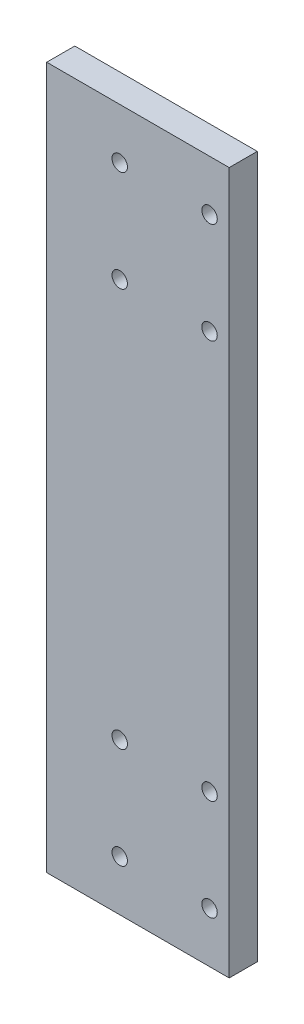
ISO-10303-21;
HEADER;
FILE_DESCRIPTION(('STEP AP214'),'2;1');
FILE_NAME('part.step','',(''),(''),'','','');
FILE_SCHEMA(('AUTOMOTIVE_DESIGN { 1 0 10303 214 1 1 1 1 }'));
ENDSEC;
DATA;
#1=APPLICATION_CONTEXT('core data for automotive mechanical design processes');
#2=APPLICATION_PROTOCOL_DEFINITION('international standard','automotive_design',2000,#1);
#3=PRODUCT_CONTEXT('',#1,'mechanical');
#4=PRODUCT('Part','Part','',(#3));
#5=PRODUCT_RELATED_PRODUCT_CATEGORY('part','',(#4));
#6=PRODUCT_DEFINITION_FORMATION('','',#4);
#7=PRODUCT_DEFINITION_CONTEXT('part definition',#1,'design');
#8=PRODUCT_DEFINITION('design','',#6,#7);
#9=PRODUCT_DEFINITION_SHAPE('','',#8);
#10=(LENGTH_UNIT() NAMED_UNIT(*) SI_UNIT(.MILLI.,.METRE.));
#11=(NAMED_UNIT(*) PLANE_ANGLE_UNIT() SI_UNIT($,.RADIAN.));
#12=(NAMED_UNIT(*) SI_UNIT($,.STERADIAN.) SOLID_ANGLE_UNIT());
#13=UNCERTAINTY_MEASURE_WITH_UNIT(LENGTH_MEASURE(1.E-05),#10,'distance_accuracy_value','');
#14=(GEOMETRIC_REPRESENTATION_CONTEXT(3) GLOBAL_UNCERTAINTY_ASSIGNED_CONTEXT((#13)) GLOBAL_UNIT_ASSIGNED_CONTEXT((#10,
#11,#12)) REPRESENTATION_CONTEXT('',''));
#15=CARTESIAN_POINT('',(0.,0.,0.));
#16=DIRECTION('',(0.,0.,1.));
#17=DIRECTION('',(1.,0.,0.));
#18=AXIS2_PLACEMENT_3D('',#15,#16,#17);
#19=CARTESIAN_POINT('',(32.5,125.,10.));
#20=DIRECTION('',(-1.,0.,0.));
#21=DIRECTION('',(0.,-1.,0.));
#22=AXIS2_PLACEMENT_3D('',#19,#20,#21);
#23=PLANE('',#22);
#24=DIRECTION('',(0.,1.,0.));
#25=VECTOR('',#24,1.);
#26=CARTESIAN_POINT('',(32.5,125.,0.));
#27=LINE('',#26,#25);
#28=CARTESIAN_POINT('',(32.5,-125.,0.));
#29=VERTEX_POINT('',#28);
#30=CARTESIAN_POINT('',(32.5,125.,0.));
#31=VERTEX_POINT('',#30);
#32=EDGE_CURVE('E252',#29,#31,#27,.T.);
#33=ORIENTED_EDGE('',*,*,#32,.T.);
#34=DIRECTION('',(0.,0.,-1.));
#35=VECTOR('',#34,1.);
#36=CARTESIAN_POINT('',(32.5,125.,10.));
#37=LINE('',#36,#35);
#38=CARTESIAN_POINT('',(32.5,125.,10.));
#39=VERTEX_POINT('',#38);
#40=EDGE_CURVE('E11',#39,#31,#37,.T.);
#41=ORIENTED_EDGE('',*,*,#40,.F.);
#42=DIRECTION('',(0.,1.,0.));
#43=VECTOR('',#42,1.);
#44=CARTESIAN_POINT('',(32.5,125.,10.));
#45=LINE('',#44,#43);
#46=CARTESIAN_POINT('',(32.5,-125.,10.));
#47=VERTEX_POINT('',#46);
#48=EDGE_CURVE('E245',#47,#39,#45,.T.);
#49=ORIENTED_EDGE('',*,*,#48,.F.);
#50=DIRECTION('',(0.,0.,-1.));
#51=VECTOR('',#50,1.);
#52=CARTESIAN_POINT('',(32.5,-125.,10.));
#53=LINE('',#52,#51);
#54=EDGE_CURVE('E251',#47,#29,#53,.T.);
#55=ORIENTED_EDGE('',*,*,#54,.T.);
#56=EDGE_LOOP('',(#33,#41,#49,#55));
#57=FACE_BOUND('',#56,.T.);
#58=ADVANCED_FACE('F44',(#57),#23,.F.);
#59=CARTESIAN_POINT('',(-32.5,125.,10.));
#60=DIRECTION('',(0.,-1.,0.));
#61=DIRECTION('',(0.,0.,-1.));
#62=AXIS2_PLACEMENT_3D('',#59,#60,#61);
#63=PLANE('',#62);
#64=DIRECTION('',(-1.,0.,0.));
#65=VECTOR('',#64,1.);
#66=CARTESIAN_POINT('',(-32.5,125.,0.));
#67=LINE('',#66,#65);
#68=CARTESIAN_POINT('',(-32.5,125.,0.));
#69=VERTEX_POINT('',#68);
#70=EDGE_CURVE('E255',#31,#69,#67,.T.);
#71=ORIENTED_EDGE('',*,*,#70,.T.);
#72=DIRECTION('',(0.,0.,-1.));
#73=VECTOR('',#72,1.);
#74=CARTESIAN_POINT('',(-32.5,125.,10.));
#75=LINE('',#74,#73);
#76=CARTESIAN_POINT('',(-32.5,125.,10.));
#77=VERTEX_POINT('',#76);
#78=EDGE_CURVE('E53',#77,#69,#75,.T.);
#79=ORIENTED_EDGE('',*,*,#78,.F.);
#80=DIRECTION('',(-1.,0.,0.));
#81=VECTOR('',#80,1.);
#82=CARTESIAN_POINT('',(-32.5,125.,10.));
#83=LINE('',#82,#81);
#84=EDGE_CURVE('E93',#39,#77,#83,.T.);
#85=ORIENTED_EDGE('',*,*,#84,.F.);
#86=ORIENTED_EDGE('',*,*,#40,.T.);
#87=EDGE_LOOP('',(#71,#79,#85,#86));
#88=FACE_BOUND('',#87,.T.);
#89=ADVANCED_FACE('F302',(#88),#63,.F.);
#90=CARTESIAN_POINT('',(-32.5,125.,10.));
#91=DIRECTION('',(1.,0.,0.));
#92=DIRECTION('',(0.,1.,0.));
#93=AXIS2_PLACEMENT_3D('',#90,#91,#92);
#94=PLANE('',#93);
#95=CARTESIAN_POINT('',(-32.5,-70.,5.));
#96=DIRECTION('',(-1.,0.,0.));
#97=DIRECTION('',(0.,0.,1.));
#98=AXIS2_PLACEMENT_3D('',#95,#96,#97);
#99=CIRCLE('',#98,2.5);
#100=CARTESIAN_POINT('',(-32.5,-70.,7.5));
#101=VERTEX_POINT('',#100);
#102=EDGE_CURVE('E126',#101,#101,#99,.T.);
#103=ORIENTED_EDGE('',*,*,#102,.F.);
#104=EDGE_LOOP('',(#103));
#105=FACE_BOUND('',#104,.T.);
#106=CARTESIAN_POINT('',(-32.5,-35.,5.));
#107=DIRECTION('',(-1.,0.,0.));
#108=DIRECTION('',(0.,0.,1.));
#109=AXIS2_PLACEMENT_3D('',#106,#107,#108);
#110=CIRCLE('',#109,2.5);
#111=CARTESIAN_POINT('',(-32.5,-35.,7.5));
#112=VERTEX_POINT('',#111);
#113=EDGE_CURVE('E125',#112,#112,#110,.T.);
#114=ORIENTED_EDGE('',*,*,#113,.F.);
#115=EDGE_LOOP('',(#114));
#116=FACE_BOUND('',#115,.T.);
#117=CARTESIAN_POINT('',(-32.5,0.,5.));
#118=DIRECTION('',(-1.,0.,0.));
#119=DIRECTION('',(0.,0.,1.));
#120=AXIS2_PLACEMENT_3D('',#117,#118,#119);
#121=CIRCLE('',#120,2.5);
#122=CARTESIAN_POINT('',(-32.5,0.,7.5));
#123=VERTEX_POINT('',#122);
#124=EDGE_CURVE('E136',#123,#123,#121,.T.);
#125=ORIENTED_EDGE('',*,*,#124,.F.);
#126=EDGE_LOOP('',(#125));
#127=FACE_BOUND('',#126,.T.);
#128=CARTESIAN_POINT('',(-32.5,35.,5.));
#129=DIRECTION('',(-1.,0.,0.));
#130=DIRECTION('',(0.,0.,1.));
#131=AXIS2_PLACEMENT_3D('',#128,#129,#130);
#132=CIRCLE('',#131,2.5);
#133=CARTESIAN_POINT('',(-32.5,35.,7.5));
#134=VERTEX_POINT('',#133);
#135=EDGE_CURVE('E142',#134,#134,#132,.T.);
#136=ORIENTED_EDGE('',*,*,#135,.F.);
#137=EDGE_LOOP('',(#136));
#138=FACE_BOUND('',#137,.T.);
#139=CARTESIAN_POINT('',(-32.5,70.,5.));
#140=DIRECTION('',(-1.,0.,0.));
#141=DIRECTION('',(0.,0.,1.));
#142=AXIS2_PLACEMENT_3D('',#139,#140,#141);
#143=CIRCLE('',#142,2.5);
#144=CARTESIAN_POINT('',(-32.5,70.,7.5));
#145=VERTEX_POINT('',#144);
#146=EDGE_CURVE('E148',#145,#145,#143,.T.);
#147=ORIENTED_EDGE('',*,*,#146,.F.);
#148=EDGE_LOOP('',(#147));
#149=FACE_BOUND('',#148,.T.);
#150=CARTESIAN_POINT('',(-32.5,-105.,5.));
#151=DIRECTION('',(-1.,0.,0.));
#152=DIRECTION('',(0.,0.,1.));
#153=AXIS2_PLACEMENT_3D('',#150,#151,#152);
#154=CIRCLE('',#153,2.5);
#155=CARTESIAN_POINT('',(-32.5,-105.,7.5));
#156=VERTEX_POINT('',#155);
#157=EDGE_CURVE('E154',#156,#156,#154,.T.);
#158=ORIENTED_EDGE('',*,*,#157,.F.);
#159=EDGE_LOOP('',(#158));
#160=FACE_BOUND('',#159,.T.);
#161=CARTESIAN_POINT('',(-32.5,105.,5.));
#162=DIRECTION('',(-1.,0.,0.));
#163=DIRECTION('',(0.,0.,1.));
#164=AXIS2_PLACEMENT_3D('',#161,#162,#163);
#165=CIRCLE('',#164,2.5);
#166=CARTESIAN_POINT('',(-32.5,105.,7.5));
#167=VERTEX_POINT('',#166);
#168=EDGE_CURVE('E160',#167,#167,#165,.T.);
#169=ORIENTED_EDGE('',*,*,#168,.F.);
#170=EDGE_LOOP('',(#169));
#171=FACE_BOUND('',#170,.T.);
#172=DIRECTION('',(0.,-1.,0.));
#173=VECTOR('',#172,1.);
#174=CARTESIAN_POINT('',(-32.5,125.,0.));
#175=LINE('',#174,#173);
#176=CARTESIAN_POINT('',(-32.5,-125.,0.));
#177=VERTEX_POINT('',#176);
#178=EDGE_CURVE('E80',#69,#177,#175,.T.);
#179=ORIENTED_EDGE('',*,*,#178,.T.);
#180=DIRECTION('',(0.,0.,-1.));
#181=VECTOR('',#180,1.);
#182=CARTESIAN_POINT('',(-32.5,-125.,10.));
#183=LINE('',#182,#181);
#184=CARTESIAN_POINT('',(-32.5,-125.,10.));
#185=VERTEX_POINT('',#184);
#186=EDGE_CURVE('E260',#185,#177,#183,.T.);
#187=ORIENTED_EDGE('',*,*,#186,.F.);
#188=DIRECTION('',(0.,-1.,0.));
#189=VECTOR('',#188,1.);
#190=CARTESIAN_POINT('',(-32.5,125.,10.));
#191=LINE('',#190,#189);
#192=EDGE_CURVE('E248',#77,#185,#191,.T.);
#193=ORIENTED_EDGE('',*,*,#192,.F.);
#194=ORIENTED_EDGE('',*,*,#78,.T.);
#195=EDGE_LOOP('',(#179,#187,#193,#194));
#196=FACE_BOUND('',#195,.T.);
#197=ADVANCED_FACE('F305',(#105,#116,#127,#138,#149,#160,#171,#196),#94,.F.);
#198=CARTESIAN_POINT('',(-32.5,-125.,10.));
#199=DIRECTION('',(0.,1.,0.));
#200=DIRECTION('',(0.,0.,1.));
#201=AXIS2_PLACEMENT_3D('',#198,#199,#200);
#202=PLANE('',#201);
#203=DIRECTION('',(1.,0.,0.));
#204=VECTOR('',#203,1.);
#205=CARTESIAN_POINT('',(-32.5,-125.,0.));
#206=LINE('',#205,#204);
#207=EDGE_CURVE('E86',#177,#29,#206,.T.);
#208=ORIENTED_EDGE('',*,*,#207,.T.);
#209=ORIENTED_EDGE('',*,*,#54,.F.);
#210=DIRECTION('',(1.,0.,0.));
#211=VECTOR('',#210,1.);
#212=CARTESIAN_POINT('',(-32.5,-125.,10.));
#213=LINE('',#212,#211);
#214=EDGE_CURVE('E62',#185,#47,#213,.T.);
#215=ORIENTED_EDGE('',*,*,#214,.F.);
#216=ORIENTED_EDGE('',*,*,#186,.T.);
#217=EDGE_LOOP('',(#208,#209,#215,#216));
#218=FACE_BOUND('',#217,.T.);
#219=ADVANCED_FACE('F284',(#218),#202,.F.);
#220=CARTESIAN_POINT('',(0.,0.,10.));
#221=DIRECTION('',(0.,0.,1.));
#222=DIRECTION('',(1.,0.,0.));
#223=AXIS2_PLACEMENT_3D('',#220,#221,#222);
#224=PLANE('',#223);
#225=CARTESIAN_POINT('',(-6.49999999999999,107.,10.));
#226=DIRECTION('',(0.,0.,1.));
#227=DIRECTION('',(1.,0.,0.));
#228=AXIS2_PLACEMENT_3D('',#225,#226,#227);
#229=CIRCLE('',#228,2.75);
#230=CARTESIAN_POINT('',(-3.75,107.,10.));
#231=VERTEX_POINT('',#230);
#232=EDGE_CURVE('E47',#231,#231,#229,.T.);
#233=ORIENTED_EDGE('',*,*,#232,.F.);
#234=EDGE_LOOP('',(#233));
#235=FACE_BOUND('',#234,.T.);
#236=CARTESIAN_POINT('',(25.5,107.,10.));
#237=DIRECTION('',(0.,0.,1.));
#238=DIRECTION('',(1.,0.,0.));
#239=AXIS2_PLACEMENT_3D('',#236,#237,#238);
#240=CIRCLE('',#239,2.75);
#241=CARTESIAN_POINT('',(28.25,107.,10.));
#242=VERTEX_POINT('',#241);
#243=EDGE_CURVE('E184',#242,#242,#240,.T.);
#244=ORIENTED_EDGE('',*,*,#243,.F.);
#245=EDGE_LOOP('',(#244));
#246=FACE_BOUND('',#245,.T.);
#247=CARTESIAN_POINT('',(-6.5,71.,10.));
#248=DIRECTION('',(0.,0.,1.));
#249=DIRECTION('',(1.,0.,0.));
#250=AXIS2_PLACEMENT_3D('',#247,#248,#249);
#251=CIRCLE('',#250,2.75);
#252=CARTESIAN_POINT('',(-3.75000000000001,71.,10.));
#253=VERTEX_POINT('',#252);
#254=EDGE_CURVE('E194',#253,#253,#251,.T.);
#255=ORIENTED_EDGE('',*,*,#254,.F.);
#256=EDGE_LOOP('',(#255));
#257=FACE_BOUND('',#256,.T.);
#258=CARTESIAN_POINT('',(25.5,71.,10.));
#259=DIRECTION('',(0.,0.,1.));
#260=DIRECTION('',(1.,0.,0.));
#261=AXIS2_PLACEMENT_3D('',#258,#259,#260);
#262=CIRCLE('',#261,2.75);
#263=CARTESIAN_POINT('',(28.25,71.,10.));
#264=VERTEX_POINT('',#263);
#265=EDGE_CURVE('E204',#264,#264,#262,.T.);
#266=ORIENTED_EDGE('',*,*,#265,.F.);
#267=EDGE_LOOP('',(#266));
#268=FACE_BOUND('',#267,.T.);
#269=CARTESIAN_POINT('',(25.5,-71.,10.));
#270=DIRECTION('',(0.,0.,1.));
#271=DIRECTION('',(1.,0.,0.));
#272=AXIS2_PLACEMENT_3D('',#269,#270,#271);
#273=CIRCLE('',#272,2.75);
#274=CARTESIAN_POINT('',(28.25,-71.,10.));
#275=VERTEX_POINT('',#274);
#276=EDGE_CURVE('E214',#275,#275,#273,.T.);
#277=ORIENTED_EDGE('',*,*,#276,.F.);
#278=EDGE_LOOP('',(#277));
#279=FACE_BOUND('',#278,.T.);
#280=CARTESIAN_POINT('',(-6.5,-71.,10.));
#281=DIRECTION('',(0.,0.,1.));
#282=DIRECTION('',(1.,0.,0.));
#283=AXIS2_PLACEMENT_3D('',#280,#281,#282);
#284=CIRCLE('',#283,2.75);
#285=CARTESIAN_POINT('',(-3.75000000000001,-71.,10.));
#286=VERTEX_POINT('',#285);
#287=EDGE_CURVE('E224',#286,#286,#284,.T.);
#288=ORIENTED_EDGE('',*,*,#287,.F.);
#289=EDGE_LOOP('',(#288));
#290=FACE_BOUND('',#289,.T.);
#291=CARTESIAN_POINT('',(-6.49999999999999,-107.,10.));
#292=DIRECTION('',(0.,0.,1.));
#293=DIRECTION('',(1.,0.,0.));
#294=AXIS2_PLACEMENT_3D('',#291,#292,#293);
#295=CIRCLE('',#294,2.75);
#296=CARTESIAN_POINT('',(-3.75,-107.,10.));
#297=VERTEX_POINT('',#296);
#298=EDGE_CURVE('E234',#297,#297,#295,.T.);
#299=ORIENTED_EDGE('',*,*,#298,.F.);
#300=EDGE_LOOP('',(#299));
#301=FACE_BOUND('',#300,.T.);
#302=CARTESIAN_POINT('',(25.5,-107.,10.));
#303=DIRECTION('',(0.,0.,1.));
#304=DIRECTION('',(1.,0.,0.));
#305=AXIS2_PLACEMENT_3D('',#302,#303,#304);
#306=CIRCLE('',#305,2.75);
#307=CARTESIAN_POINT('',(28.25,-107.,10.));
#308=VERTEX_POINT('',#307);
#309=EDGE_CURVE('E244',#308,#308,#306,.T.);
#310=ORIENTED_EDGE('',*,*,#309,.F.);
#311=EDGE_LOOP('',(#310));
#312=FACE_BOUND('',#311,.T.);
#313=ORIENTED_EDGE('',*,*,#48,.T.);
#314=ORIENTED_EDGE('',*,*,#84,.T.);
#315=ORIENTED_EDGE('',*,*,#192,.T.);
#316=ORIENTED_EDGE('',*,*,#214,.T.);
#317=EDGE_LOOP('',(#313,#314,#315,#316));
#318=FACE_BOUND('',#317,.T.);
#319=ADVANCED_FACE('F280',(#235,#246,#257,#268,#279,#290,#301,#312,#318),#224,.T.);
#320=CARTESIAN_POINT('',(0.,0.,0.));
#321=DIRECTION('',(0.,0.,1.));
#322=DIRECTION('',(1.,0.,0.));
#323=AXIS2_PLACEMENT_3D('',#320,#321,#322);
#324=PLANE('',#323);
#325=CARTESIAN_POINT('',(-6.49999999999999,107.,0.));
#326=DIRECTION('',(0.,0.,-1.));
#327=DIRECTION('',(-1.,0.,0.));
#328=AXIS2_PLACEMENT_3D('',#325,#326,#327);
#329=CIRCLE('',#328,5.);
#330=CARTESIAN_POINT('',(-11.5,107.,0.));
#331=VERTEX_POINT('',#330);
#332=EDGE_CURVE('E166',#331,#331,#329,.T.);
#333=ORIENTED_EDGE('',*,*,#332,.F.);
#334=EDGE_LOOP('',(#333));
#335=FACE_BOUND('',#334,.T.);
#336=CARTESIAN_POINT('',(25.5,107.,0.));
#337=DIRECTION('',(0.,0.,-1.));
#338=DIRECTION('',(-1.,0.,0.));
#339=AXIS2_PLACEMENT_3D('',#336,#337,#338);
#340=CIRCLE('',#339,5.);
#341=CARTESIAN_POINT('',(20.5,107.,0.));
#342=VERTEX_POINT('',#341);
#343=EDGE_CURVE('E175',#342,#342,#340,.T.);
#344=ORIENTED_EDGE('',*,*,#343,.F.);
#345=EDGE_LOOP('',(#344));
#346=FACE_BOUND('',#345,.T.);
#347=CARTESIAN_POINT('',(-6.5,71.,0.));
#348=DIRECTION('',(0.,0.,-1.));
#349=DIRECTION('',(-1.,0.,0.));
#350=AXIS2_PLACEMENT_3D('',#347,#348,#349);
#351=CIRCLE('',#350,5.);
#352=CARTESIAN_POINT('',(-11.5,71.,0.));
#353=VERTEX_POINT('',#352);
#354=EDGE_CURVE('E185',#353,#353,#351,.T.);
#355=ORIENTED_EDGE('',*,*,#354,.F.);
#356=EDGE_LOOP('',(#355));
#357=FACE_BOUND('',#356,.T.);
#358=CARTESIAN_POINT('',(25.5,71.,0.));
#359=DIRECTION('',(0.,0.,-1.));
#360=DIRECTION('',(-1.,0.,0.));
#361=AXIS2_PLACEMENT_3D('',#358,#359,#360);
#362=CIRCLE('',#361,5.);
#363=CARTESIAN_POINT('',(20.5,71.,0.));
#364=VERTEX_POINT('',#363);
#365=EDGE_CURVE('E195',#364,#364,#362,.T.);
#366=ORIENTED_EDGE('',*,*,#365,.F.);
#367=EDGE_LOOP('',(#366));
#368=FACE_BOUND('',#367,.T.);
#369=CARTESIAN_POINT('',(25.5,-71.,0.));
#370=DIRECTION('',(0.,0.,-1.));
#371=DIRECTION('',(-1.,0.,0.));
#372=AXIS2_PLACEMENT_3D('',#369,#370,#371);
#373=CIRCLE('',#372,5.);
#374=CARTESIAN_POINT('',(20.5,-71.,0.));
#375=VERTEX_POINT('',#374);
#376=EDGE_CURVE('E205',#375,#375,#373,.T.);
#377=ORIENTED_EDGE('',*,*,#376,.F.);
#378=EDGE_LOOP('',(#377));
#379=FACE_BOUND('',#378,.T.);
#380=CARTESIAN_POINT('',(-6.5,-71.,0.));
#381=DIRECTION('',(0.,0.,-1.));
#382=DIRECTION('',(-1.,0.,0.));
#383=AXIS2_PLACEMENT_3D('',#380,#381,#382);
#384=CIRCLE('',#383,5.);
#385=CARTESIAN_POINT('',(-11.5,-71.,0.));
#386=VERTEX_POINT('',#385);
#387=EDGE_CURVE('E215',#386,#386,#384,.T.);
#388=ORIENTED_EDGE('',*,*,#387,.F.);
#389=EDGE_LOOP('',(#388));
#390=FACE_BOUND('',#389,.T.);
#391=CARTESIAN_POINT('',(-6.49999999999999,-107.,0.));
#392=DIRECTION('',(0.,0.,-1.));
#393=DIRECTION('',(-1.,0.,0.));
#394=AXIS2_PLACEMENT_3D('',#391,#392,#393);
#395=CIRCLE('',#394,5.);
#396=CARTESIAN_POINT('',(-11.5,-107.,0.));
#397=VERTEX_POINT('',#396);
#398=EDGE_CURVE('E225',#397,#397,#395,.T.);
#399=ORIENTED_EDGE('',*,*,#398,.F.);
#400=EDGE_LOOP('',(#399));
#401=FACE_BOUND('',#400,.T.);
#402=CARTESIAN_POINT('',(25.5,-107.,0.));
#403=DIRECTION('',(0.,0.,-1.));
#404=DIRECTION('',(-1.,0.,0.));
#405=AXIS2_PLACEMENT_3D('',#402,#403,#404);
#406=CIRCLE('',#405,5.);
#407=CARTESIAN_POINT('',(20.5,-107.,0.));
#408=VERTEX_POINT('',#407);
#409=EDGE_CURVE('E235',#408,#408,#406,.T.);
#410=ORIENTED_EDGE('',*,*,#409,.F.);
#411=EDGE_LOOP('',(#410));
#412=FACE_BOUND('',#411,.T.);
#413=ORIENTED_EDGE('',*,*,#32,.F.);
#414=ORIENTED_EDGE('',*,*,#207,.F.);
#415=ORIENTED_EDGE('',*,*,#178,.F.);
#416=ORIENTED_EDGE('',*,*,#70,.F.);
#417=EDGE_LOOP('',(#413,#414,#415,#416));
#418=FACE_BOUND('',#417,.T.);
#419=ADVANCED_FACE('F283',(#335,#346,#357,#368,#379,#390,#401,#412,#418),#324,.F.);
#420=CARTESIAN_POINT('',(25.5,-107.,0.));
#421=DIRECTION('',(0.,0.,-1.));
#422=DIRECTION('',(-1.,0.,0.));
#423=AXIS2_PLACEMENT_3D('',#420,#421,#422);
#424=CYLINDRICAL_SURFACE('',#423,2.75);
#425=ORIENTED_EDGE('',*,*,#309,.T.);
#426=EDGE_LOOP('',(#425));
#427=FACE_BOUND('',#426,.T.);
#428=CARTESIAN_POINT('',(25.5,-107.,5.7));
#429=DIRECTION('',(0.,0.,-1.));
#430=DIRECTION('',(-1.,0.,0.));
#431=AXIS2_PLACEMENT_3D('',#428,#429,#430);
#432=CIRCLE('',#431,2.75);
#433=CARTESIAN_POINT('',(22.75,-107.,5.7));
#434=VERTEX_POINT('',#433);
#435=EDGE_CURVE('E241',#434,#434,#432,.T.);
#436=ORIENTED_EDGE('',*,*,#435,.T.);
#437=EDGE_LOOP('',(#436));
#438=FACE_BOUND('',#437,.T.);
#439=ADVANCED_FACE('F307',(#427,#438),#424,.F.);
#440=CARTESIAN_POINT('',(28.25,-107.,5.7));
#441=DIRECTION('',(0.,0.,1.));
#442=DIRECTION('',(1.,0.,0.));
#443=AXIS2_PLACEMENT_3D('',#440,#441,#442);
#444=PLANE('',#443);
#445=ORIENTED_EDGE('',*,*,#435,.F.);
#446=EDGE_LOOP('',(#445));
#447=FACE_BOUND('',#446,.T.);
#448=CARTESIAN_POINT('',(25.5,-107.,5.7));
#449=DIRECTION('',(0.,0.,-1.));
#450=DIRECTION('',(-1.,0.,0.));
#451=AXIS2_PLACEMENT_3D('',#448,#449,#450);
#452=CIRCLE('',#451,5.);
#453=CARTESIAN_POINT('',(20.5,-107.,5.7));
#454=VERTEX_POINT('',#453);
#455=EDGE_CURVE('E238',#454,#454,#452,.T.);
#456=ORIENTED_EDGE('',*,*,#455,.T.);
#457=EDGE_LOOP('',(#456));
#458=FACE_BOUND('',#457,.T.);
#459=ADVANCED_FACE('F314',(#447,#458),#444,.F.);
#460=CARTESIAN_POINT('',(25.5,-107.,0.));
#461=DIRECTION('',(0.,0.,-1.));
#462=DIRECTION('',(-1.,0.,0.));
#463=AXIS2_PLACEMENT_3D('',#460,#461,#462);
#464=CYLINDRICAL_SURFACE('',#463,5.);
#465=ORIENTED_EDGE('',*,*,#455,.F.);
#466=EDGE_LOOP('',(#465));
#467=FACE_BOUND('',#466,.T.);
#468=ORIENTED_EDGE('',*,*,#409,.T.);
#469=EDGE_LOOP('',(#468));
#470=FACE_BOUND('',#469,.T.);
#471=ADVANCED_FACE('F355',(#467,#470),#464,.F.);
#472=CARTESIAN_POINT('',(-6.49999999999999,-107.,0.));
#473=DIRECTION('',(0.,0.,-1.));
#474=DIRECTION('',(-1.,0.,0.));
#475=AXIS2_PLACEMENT_3D('',#472,#473,#474);
#476=CYLINDRICAL_SURFACE('',#475,2.75);
#477=ORIENTED_EDGE('',*,*,#298,.T.);
#478=EDGE_LOOP('',(#477));
#479=FACE_BOUND('',#478,.T.);
#480=CARTESIAN_POINT('',(-6.49999999999999,-107.,5.7));
#481=DIRECTION('',(0.,0.,-1.));
#482=DIRECTION('',(-1.,0.,0.));
#483=AXIS2_PLACEMENT_3D('',#480,#481,#482);
#484=CIRCLE('',#483,2.75);
#485=CARTESIAN_POINT('',(-9.24999999999999,-107.,5.7));
#486=VERTEX_POINT('',#485);
#487=EDGE_CURVE('E231',#486,#486,#484,.T.);
#488=ORIENTED_EDGE('',*,*,#487,.T.);
#489=EDGE_LOOP('',(#488));
#490=FACE_BOUND('',#489,.T.);
#491=ADVANCED_FACE('F363',(#479,#490),#476,.F.);
#492=CARTESIAN_POINT('',(-3.75,-107.,5.7));
#493=DIRECTION('',(0.,0.,1.));
#494=DIRECTION('',(1.,0.,0.));
#495=AXIS2_PLACEMENT_3D('',#492,#493,#494);
#496=PLANE('',#495);
#497=ORIENTED_EDGE('',*,*,#487,.F.);
#498=EDGE_LOOP('',(#497));
#499=FACE_BOUND('',#498,.T.);
#500=CARTESIAN_POINT('',(-6.49999999999999,-107.,5.7));
#501=DIRECTION('',(0.,0.,-1.));
#502=DIRECTION('',(-1.,0.,0.));
#503=AXIS2_PLACEMENT_3D('',#500,#501,#502);
#504=CIRCLE('',#503,5.);
#505=CARTESIAN_POINT('',(-11.5,-107.,5.7));
#506=VERTEX_POINT('',#505);
#507=EDGE_CURVE('E228',#506,#506,#504,.T.);
#508=ORIENTED_EDGE('',*,*,#507,.T.);
#509=EDGE_LOOP('',(#508));
#510=FACE_BOUND('',#509,.T.);
#511=ADVANCED_FACE('F371',(#499,#510),#496,.F.);
#512=CARTESIAN_POINT('',(-6.49999999999999,-107.,0.));
#513=DIRECTION('',(0.,0.,-1.));
#514=DIRECTION('',(-1.,0.,0.));
#515=AXIS2_PLACEMENT_3D('',#512,#513,#514);
#516=CYLINDRICAL_SURFACE('',#515,5.);
#517=ORIENTED_EDGE('',*,*,#507,.F.);
#518=EDGE_LOOP('',(#517));
#519=FACE_BOUND('',#518,.T.);
#520=ORIENTED_EDGE('',*,*,#398,.T.);
#521=EDGE_LOOP('',(#520));
#522=FACE_BOUND('',#521,.T.);
#523=ADVANCED_FACE('F379',(#519,#522),#516,.F.);
#524=CARTESIAN_POINT('',(-6.5,-71.,0.));
#525=DIRECTION('',(0.,0.,-1.));
#526=DIRECTION('',(-1.,0.,0.));
#527=AXIS2_PLACEMENT_3D('',#524,#525,#526);
#528=CYLINDRICAL_SURFACE('',#527,2.75);
#529=ORIENTED_EDGE('',*,*,#287,.T.);
#530=EDGE_LOOP('',(#529));
#531=FACE_BOUND('',#530,.T.);
#532=CARTESIAN_POINT('',(-6.5,-71.,5.7));
#533=DIRECTION('',(0.,0.,-1.));
#534=DIRECTION('',(-1.,0.,0.));
#535=AXIS2_PLACEMENT_3D('',#532,#533,#534);
#536=CIRCLE('',#535,2.75);
#537=CARTESIAN_POINT('',(-9.25,-71.,5.7));
#538=VERTEX_POINT('',#537);
#539=EDGE_CURVE('E221',#538,#538,#536,.T.);
#540=ORIENTED_EDGE('',*,*,#539,.T.);
#541=EDGE_LOOP('',(#540));
#542=FACE_BOUND('',#541,.T.);
#543=ADVANCED_FACE('F387',(#531,#542),#528,.F.);
#544=CARTESIAN_POINT('',(-3.75000000000001,-71.,5.7));
#545=DIRECTION('',(0.,0.,1.));
#546=DIRECTION('',(1.,0.,0.));
#547=AXIS2_PLACEMENT_3D('',#544,#545,#546);
#548=PLANE('',#547);
#549=ORIENTED_EDGE('',*,*,#539,.F.);
#550=EDGE_LOOP('',(#549));
#551=FACE_BOUND('',#550,.T.);
#552=CARTESIAN_POINT('',(-6.5,-71.,5.7));
#553=DIRECTION('',(0.,0.,-1.));
#554=DIRECTION('',(-1.,0.,0.));
#555=AXIS2_PLACEMENT_3D('',#552,#553,#554);
#556=CIRCLE('',#555,5.);
#557=CARTESIAN_POINT('',(-11.5,-71.,5.7));
#558=VERTEX_POINT('',#557);
#559=EDGE_CURVE('E218',#558,#558,#556,.T.);
#560=ORIENTED_EDGE('',*,*,#559,.T.);
#561=EDGE_LOOP('',(#560));
#562=FACE_BOUND('',#561,.T.);
#563=ADVANCED_FACE('F395',(#551,#562),#548,.F.);
#564=CARTESIAN_POINT('',(-6.5,-71.,0.));
#565=DIRECTION('',(0.,0.,-1.));
#566=DIRECTION('',(-1.,0.,0.));
#567=AXIS2_PLACEMENT_3D('',#564,#565,#566);
#568=CYLINDRICAL_SURFACE('',#567,5.);
#569=ORIENTED_EDGE('',*,*,#559,.F.);
#570=EDGE_LOOP('',(#569));
#571=FACE_BOUND('',#570,.T.);
#572=ORIENTED_EDGE('',*,*,#387,.T.);
#573=EDGE_LOOP('',(#572));
#574=FACE_BOUND('',#573,.T.);
#575=ADVANCED_FACE('F403',(#571,#574),#568,.F.);
#576=CARTESIAN_POINT('',(25.5,-71.,0.));
#577=DIRECTION('',(0.,0.,-1.));
#578=DIRECTION('',(-1.,0.,0.));
#579=AXIS2_PLACEMENT_3D('',#576,#577,#578);
#580=CYLINDRICAL_SURFACE('',#579,2.75);
#581=ORIENTED_EDGE('',*,*,#276,.T.);
#582=EDGE_LOOP('',(#581));
#583=FACE_BOUND('',#582,.T.);
#584=CARTESIAN_POINT('',(25.5,-71.,5.7));
#585=DIRECTION('',(0.,0.,-1.));
#586=DIRECTION('',(-1.,0.,0.));
#587=AXIS2_PLACEMENT_3D('',#584,#585,#586);
#588=CIRCLE('',#587,2.75);
#589=CARTESIAN_POINT('',(22.75,-71.,5.7));
#590=VERTEX_POINT('',#589);
#591=EDGE_CURVE('E211',#590,#590,#588,.T.);
#592=ORIENTED_EDGE('',*,*,#591,.T.);
#593=EDGE_LOOP('',(#592));
#594=FACE_BOUND('',#593,.T.);
#595=ADVANCED_FACE('F411',(#583,#594),#580,.F.);
#596=CARTESIAN_POINT('',(28.25,-71.,5.7));
#597=DIRECTION('',(0.,0.,1.));
#598=DIRECTION('',(1.,0.,0.));
#599=AXIS2_PLACEMENT_3D('',#596,#597,#598);
#600=PLANE('',#599);
#601=ORIENTED_EDGE('',*,*,#591,.F.);
#602=EDGE_LOOP('',(#601));
#603=FACE_BOUND('',#602,.T.);
#604=CARTESIAN_POINT('',(25.5,-71.,5.7));
#605=DIRECTION('',(0.,0.,-1.));
#606=DIRECTION('',(-1.,0.,0.));
#607=AXIS2_PLACEMENT_3D('',#604,#605,#606);
#608=CIRCLE('',#607,5.);
#609=CARTESIAN_POINT('',(20.5,-71.,5.7));
#610=VERTEX_POINT('',#609);
#611=EDGE_CURVE('E208',#610,#610,#608,.T.);
#612=ORIENTED_EDGE('',*,*,#611,.T.);
#613=EDGE_LOOP('',(#612));
#614=FACE_BOUND('',#613,.T.);
#615=ADVANCED_FACE('F419',(#603,#614),#600,.F.);
#616=CARTESIAN_POINT('',(25.5,-71.,0.));
#617=DIRECTION('',(0.,0.,-1.));
#618=DIRECTION('',(-1.,0.,0.));
#619=AXIS2_PLACEMENT_3D('',#616,#617,#618);
#620=CYLINDRICAL_SURFACE('',#619,5.);
#621=ORIENTED_EDGE('',*,*,#611,.F.);
#622=EDGE_LOOP('',(#621));
#623=FACE_BOUND('',#622,.T.);
#624=ORIENTED_EDGE('',*,*,#376,.T.);
#625=EDGE_LOOP('',(#624));
#626=FACE_BOUND('',#625,.T.);
#627=ADVANCED_FACE('F427',(#623,#626),#620,.F.);
#628=CARTESIAN_POINT('',(25.5,71.,0.));
#629=DIRECTION('',(0.,0.,-1.));
#630=DIRECTION('',(-1.,0.,0.));
#631=AXIS2_PLACEMENT_3D('',#628,#629,#630);
#632=CYLINDRICAL_SURFACE('',#631,2.75);
#633=ORIENTED_EDGE('',*,*,#265,.T.);
#634=EDGE_LOOP('',(#633));
#635=FACE_BOUND('',#634,.T.);
#636=CARTESIAN_POINT('',(25.5,71.,5.7));
#637=DIRECTION('',(0.,0.,-1.));
#638=DIRECTION('',(-1.,0.,0.));
#639=AXIS2_PLACEMENT_3D('',#636,#637,#638);
#640=CIRCLE('',#639,2.75);
#641=CARTESIAN_POINT('',(22.75,71.,5.7));
#642=VERTEX_POINT('',#641);
#643=EDGE_CURVE('E201',#642,#642,#640,.T.);
#644=ORIENTED_EDGE('',*,*,#643,.T.);
#645=EDGE_LOOP('',(#644));
#646=FACE_BOUND('',#645,.T.);
#647=ADVANCED_FACE('F435',(#635,#646),#632,.F.);
#648=CARTESIAN_POINT('',(28.25,71.,5.7));
#649=DIRECTION('',(0.,0.,1.));
#650=DIRECTION('',(1.,0.,0.));
#651=AXIS2_PLACEMENT_3D('',#648,#649,#650);
#652=PLANE('',#651);
#653=ORIENTED_EDGE('',*,*,#643,.F.);
#654=EDGE_LOOP('',(#653));
#655=FACE_BOUND('',#654,.T.);
#656=CARTESIAN_POINT('',(25.5,71.,5.7));
#657=DIRECTION('',(0.,0.,-1.));
#658=DIRECTION('',(-1.,0.,0.));
#659=AXIS2_PLACEMENT_3D('',#656,#657,#658);
#660=CIRCLE('',#659,5.);
#661=CARTESIAN_POINT('',(20.5,71.,5.7));
#662=VERTEX_POINT('',#661);
#663=EDGE_CURVE('E198',#662,#662,#660,.T.);
#664=ORIENTED_EDGE('',*,*,#663,.T.);
#665=EDGE_LOOP('',(#664));
#666=FACE_BOUND('',#665,.T.);
#667=ADVANCED_FACE('F443',(#655,#666),#652,.F.);
#668=CARTESIAN_POINT('',(25.5,71.,0.));
#669=DIRECTION('',(0.,0.,-1.));
#670=DIRECTION('',(-1.,0.,0.));
#671=AXIS2_PLACEMENT_3D('',#668,#669,#670);
#672=CYLINDRICAL_SURFACE('',#671,5.);
#673=ORIENTED_EDGE('',*,*,#663,.F.);
#674=EDGE_LOOP('',(#673));
#675=FACE_BOUND('',#674,.T.);
#676=ORIENTED_EDGE('',*,*,#365,.T.);
#677=EDGE_LOOP('',(#676));
#678=FACE_BOUND('',#677,.T.);
#679=ADVANCED_FACE('F451',(#675,#678),#672,.F.);
#680=CARTESIAN_POINT('',(-6.5,71.,0.));
#681=DIRECTION('',(0.,0.,-1.));
#682=DIRECTION('',(-1.,0.,0.));
#683=AXIS2_PLACEMENT_3D('',#680,#681,#682);
#684=CYLINDRICAL_SURFACE('',#683,2.75);
#685=ORIENTED_EDGE('',*,*,#254,.T.);
#686=EDGE_LOOP('',(#685));
#687=FACE_BOUND('',#686,.T.);
#688=CARTESIAN_POINT('',(-6.5,71.,5.7));
#689=DIRECTION('',(0.,0.,-1.));
#690=DIRECTION('',(-1.,0.,0.));
#691=AXIS2_PLACEMENT_3D('',#688,#689,#690);
#692=CIRCLE('',#691,2.75);
#693=CARTESIAN_POINT('',(-9.25,71.,5.7));
#694=VERTEX_POINT('',#693);
#695=EDGE_CURVE('E191',#694,#694,#692,.T.);
#696=ORIENTED_EDGE('',*,*,#695,.T.);
#697=EDGE_LOOP('',(#696));
#698=FACE_BOUND('',#697,.T.);
#699=ADVANCED_FACE('F459',(#687,#698),#684,.F.);
#700=CARTESIAN_POINT('',(-3.75000000000001,71.,5.7));
#701=DIRECTION('',(0.,0.,1.));
#702=DIRECTION('',(1.,0.,0.));
#703=AXIS2_PLACEMENT_3D('',#700,#701,#702);
#704=PLANE('',#703);
#705=ORIENTED_EDGE('',*,*,#695,.F.);
#706=EDGE_LOOP('',(#705));
#707=FACE_BOUND('',#706,.T.);
#708=CARTESIAN_POINT('',(-6.5,71.,5.7));
#709=DIRECTION('',(0.,0.,-1.));
#710=DIRECTION('',(-1.,0.,0.));
#711=AXIS2_PLACEMENT_3D('',#708,#709,#710);
#712=CIRCLE('',#711,5.);
#713=CARTESIAN_POINT('',(-11.5,71.,5.7));
#714=VERTEX_POINT('',#713);
#715=EDGE_CURVE('E188',#714,#714,#712,.T.);
#716=ORIENTED_EDGE('',*,*,#715,.T.);
#717=EDGE_LOOP('',(#716));
#718=FACE_BOUND('',#717,.T.);
#719=ADVANCED_FACE('F467',(#707,#718),#704,.F.);
#720=CARTESIAN_POINT('',(-6.5,71.,0.));
#721=DIRECTION('',(0.,0.,-1.));
#722=DIRECTION('',(-1.,0.,0.));
#723=AXIS2_PLACEMENT_3D('',#720,#721,#722);
#724=CYLINDRICAL_SURFACE('',#723,5.);
#725=ORIENTED_EDGE('',*,*,#715,.F.);
#726=EDGE_LOOP('',(#725));
#727=FACE_BOUND('',#726,.T.);
#728=ORIENTED_EDGE('',*,*,#354,.T.);
#729=EDGE_LOOP('',(#728));
#730=FACE_BOUND('',#729,.T.);
#731=ADVANCED_FACE('F475',(#727,#730),#724,.F.);
#732=CARTESIAN_POINT('',(25.5,107.,0.));
#733=DIRECTION('',(0.,0.,-1.));
#734=DIRECTION('',(-1.,0.,0.));
#735=AXIS2_PLACEMENT_3D('',#732,#733,#734);
#736=CYLINDRICAL_SURFACE('',#735,2.75);
#737=ORIENTED_EDGE('',*,*,#243,.T.);
#738=EDGE_LOOP('',(#737));
#739=FACE_BOUND('',#738,.T.);
#740=CARTESIAN_POINT('',(25.5,107.,5.7));
#741=DIRECTION('',(0.,0.,-1.));
#742=DIRECTION('',(-1.,0.,0.));
#743=AXIS2_PLACEMENT_3D('',#740,#741,#742);
#744=CIRCLE('',#743,2.75);
#745=CARTESIAN_POINT('',(22.75,107.,5.7));
#746=VERTEX_POINT('',#745);
#747=EDGE_CURVE('E181',#746,#746,#744,.T.);
#748=ORIENTED_EDGE('',*,*,#747,.T.);
#749=EDGE_LOOP('',(#748));
#750=FACE_BOUND('',#749,.T.);
#751=ADVANCED_FACE('F277',(#739,#750),#736,.F.);
#752=CARTESIAN_POINT('',(28.25,107.,5.7));
#753=DIRECTION('',(0.,0.,1.));
#754=DIRECTION('',(1.,0.,0.));
#755=AXIS2_PLACEMENT_3D('',#752,#753,#754);
#756=PLANE('',#755);
#757=ORIENTED_EDGE('',*,*,#747,.F.);
#758=EDGE_LOOP('',(#757));
#759=FACE_BOUND('',#758,.T.);
#760=CARTESIAN_POINT('',(25.5,107.,5.7));
#761=DIRECTION('',(0.,0.,-1.));
#762=DIRECTION('',(-1.,0.,0.));
#763=AXIS2_PLACEMENT_3D('',#760,#761,#762);
#764=CIRCLE('',#763,5.);
#765=CARTESIAN_POINT('',(20.5,107.,5.7));
#766=VERTEX_POINT('',#765);
#767=EDGE_CURVE('E178',#766,#766,#764,.T.);
#768=ORIENTED_EDGE('',*,*,#767,.T.);
#769=EDGE_LOOP('',(#768));
#770=FACE_BOUND('',#769,.T.);
#771=ADVANCED_FACE('F490',(#759,#770),#756,.F.);
#772=CARTESIAN_POINT('',(25.5,107.,0.));
#773=DIRECTION('',(0.,0.,-1.));
#774=DIRECTION('',(-1.,0.,0.));
#775=AXIS2_PLACEMENT_3D('',#772,#773,#774);
#776=CYLINDRICAL_SURFACE('',#775,5.);
#777=ORIENTED_EDGE('',*,*,#767,.F.);
#778=EDGE_LOOP('',(#777));
#779=FACE_BOUND('',#778,.T.);
#780=ORIENTED_EDGE('',*,*,#343,.T.);
#781=EDGE_LOOP('',(#780));
#782=FACE_BOUND('',#781,.T.);
#783=ADVANCED_FACE('F497',(#779,#782),#776,.F.);
#784=CARTESIAN_POINT('',(-6.49999999999999,107.,0.));
#785=DIRECTION('',(0.,0.,-1.));
#786=DIRECTION('',(-1.,0.,0.));
#787=AXIS2_PLACEMENT_3D('',#784,#785,#786);
#788=CYLINDRICAL_SURFACE('',#787,2.75);
#789=ORIENTED_EDGE('',*,*,#232,.T.);
#790=EDGE_LOOP('',(#789));
#791=FACE_BOUND('',#790,.T.);
#792=CARTESIAN_POINT('',(-6.49999999999999,107.,5.7));
#793=DIRECTION('',(0.,0.,-1.));
#794=DIRECTION('',(-1.,0.,0.));
#795=AXIS2_PLACEMENT_3D('',#792,#793,#794);
#796=CIRCLE('',#795,2.75);
#797=CARTESIAN_POINT('',(-9.24999999999999,107.,5.7));
#798=VERTEX_POINT('',#797);
#799=EDGE_CURVE('E172',#798,#798,#796,.T.);
#800=ORIENTED_EDGE('',*,*,#799,.T.);
#801=EDGE_LOOP('',(#800));
#802=FACE_BOUND('',#801,.T.);
#803=ADVANCED_FACE('F505',(#791,#802),#788,.F.);
#804=CARTESIAN_POINT('',(-3.75,107.,5.7));
#805=DIRECTION('',(0.,0.,1.));
#806=DIRECTION('',(1.,0.,0.));
#807=AXIS2_PLACEMENT_3D('',#804,#805,#806);
#808=PLANE('',#807);
#809=ORIENTED_EDGE('',*,*,#799,.F.);
#810=EDGE_LOOP('',(#809));
#811=FACE_BOUND('',#810,.T.);
#812=CARTESIAN_POINT('',(-6.49999999999999,107.,5.7));
#813=DIRECTION('',(0.,0.,-1.));
#814=DIRECTION('',(-1.,0.,0.));
#815=AXIS2_PLACEMENT_3D('',#812,#813,#814);
#816=CIRCLE('',#815,5.);
#817=CARTESIAN_POINT('',(-11.5,107.,5.7));
#818=VERTEX_POINT('',#817);
#819=EDGE_CURVE('E169',#818,#818,#816,.T.);
#820=ORIENTED_EDGE('',*,*,#819,.T.);
#821=EDGE_LOOP('',(#820));
#822=FACE_BOUND('',#821,.T.);
#823=ADVANCED_FACE('F513',(#811,#822),#808,.F.);
#824=CARTESIAN_POINT('',(-6.49999999999999,107.,0.));
#825=DIRECTION('',(0.,0.,-1.));
#826=DIRECTION('',(-1.,0.,0.));
#827=AXIS2_PLACEMENT_3D('',#824,#825,#826);
#828=CYLINDRICAL_SURFACE('',#827,5.);
#829=ORIENTED_EDGE('',*,*,#819,.F.);
#830=EDGE_LOOP('',(#829));
#831=FACE_BOUND('',#830,.T.);
#832=ORIENTED_EDGE('',*,*,#332,.T.);
#833=EDGE_LOOP('',(#832));
#834=FACE_BOUND('',#833,.T.);
#835=ADVANCED_FACE('F521',(#831,#834),#828,.F.);
#836=CARTESIAN_POINT('',(-15.5,105.,5.));
#837=DIRECTION('',(-1.,0.,0.));
#838=DIRECTION('',(0.,0.,1.));
#839=AXIS2_PLACEMENT_3D('',#836,#837,#838);
#840=CONICAL_SURFACE('',#839,2.49999999999999,1.02974425867665);
#841=CARTESIAN_POINT('',(-13.9978484524311,105.,5.));
#842=VERTEX_POINT('',#841);
#843=VERTEX_LOOP('',#842);
#844=FACE_BOUND('',#843,.T.);
#845=CARTESIAN_POINT('',(-15.5,105.,5.));
#846=DIRECTION('',(-1.,0.,0.));
#847=DIRECTION('',(0.,0.,1.));
#848=AXIS2_PLACEMENT_3D('',#845,#846,#847);
#849=CIRCLE('',#848,2.49999999999999);
#850=CARTESIAN_POINT('',(-15.5,105.,7.49999999999999));
#851=VERTEX_POINT('',#850);
#852=EDGE_CURVE('E163',#851,#851,#849,.T.);
#853=ORIENTED_EDGE('',*,*,#852,.T.);
#854=EDGE_LOOP('',(#853));
#855=FACE_BOUND('',#854,.T.);
#856=ADVANCED_FACE('F529',(#844,#855),#840,.F.);
#857=CARTESIAN_POINT('',(-32.5,105.,5.));
#858=DIRECTION('',(-1.,0.,0.));
#859=DIRECTION('',(0.,0.,1.));
#860=AXIS2_PLACEMENT_3D('',#857,#858,#859);
#861=CYLINDRICAL_SURFACE('',#860,2.5);
#862=ORIENTED_EDGE('',*,*,#852,.F.);
#863=EDGE_LOOP('',(#862));
#864=FACE_BOUND('',#863,.T.);
#865=ORIENTED_EDGE('',*,*,#168,.T.);
#866=EDGE_LOOP('',(#865));
#867=FACE_BOUND('',#866,.T.);
#868=ADVANCED_FACE('F537',(#864,#867),#861,.F.);
#869=CARTESIAN_POINT('',(-15.5,-105.,5.));
#870=DIRECTION('',(-1.,0.,0.));
#871=DIRECTION('',(0.,0.,1.));
#872=AXIS2_PLACEMENT_3D('',#869,#870,#871);
#873=CONICAL_SURFACE('',#872,2.5,1.02974425867666);
#874=CARTESIAN_POINT('',(-13.9978484524311,-105.,5.));
#875=VERTEX_POINT('',#874);
#876=VERTEX_LOOP('',#875);
#877=FACE_BOUND('',#876,.T.);
#878=CARTESIAN_POINT('',(-15.5,-105.,5.));
#879=DIRECTION('',(-1.,0.,0.));
#880=DIRECTION('',(0.,0.,1.));
#881=AXIS2_PLACEMENT_3D('',#878,#879,#880);
#882=CIRCLE('',#881,2.5);
#883=CARTESIAN_POINT('',(-15.5,-105.,7.5));
#884=VERTEX_POINT('',#883);
#885=EDGE_CURVE('E157',#884,#884,#882,.T.);
#886=ORIENTED_EDGE('',*,*,#885,.T.);
#887=EDGE_LOOP('',(#886));
#888=FACE_BOUND('',#887,.T.);
#889=ADVANCED_FACE('F546',(#877,#888),#873,.F.);
#890=CARTESIAN_POINT('',(-32.5,-105.,5.));
#891=DIRECTION('',(-1.,0.,0.));
#892=DIRECTION('',(0.,0.,1.));
#893=AXIS2_PLACEMENT_3D('',#890,#891,#892);
#894=CYLINDRICAL_SURFACE('',#893,2.5);
#895=ORIENTED_EDGE('',*,*,#885,.F.);
#896=EDGE_LOOP('',(#895));
#897=FACE_BOUND('',#896,.T.);
#898=ORIENTED_EDGE('',*,*,#157,.T.);
#899=EDGE_LOOP('',(#898));
#900=FACE_BOUND('',#899,.T.);
#901=ADVANCED_FACE('F555',(#897,#900),#894,.F.);
#902=CARTESIAN_POINT('',(-15.5,70.,5.));
#903=DIRECTION('',(-1.,0.,0.));
#904=DIRECTION('',(0.,0.,1.));
#905=AXIS2_PLACEMENT_3D('',#902,#903,#904);
#906=CONICAL_SURFACE('',#905,2.5,1.02974425867666);
#907=CARTESIAN_POINT('',(-13.9978484524311,70.,5.));
#908=VERTEX_POINT('',#907);
#909=VERTEX_LOOP('',#908);
#910=FACE_BOUND('',#909,.T.);
#911=CARTESIAN_POINT('',(-15.5,70.,5.));
#912=DIRECTION('',(-1.,0.,0.));
#913=DIRECTION('',(0.,0.,1.));
#914=AXIS2_PLACEMENT_3D('',#911,#912,#913);
#915=CIRCLE('',#914,2.5);
#916=CARTESIAN_POINT('',(-15.5,70.,7.5));
#917=VERTEX_POINT('',#916);
#918=EDGE_CURVE('E151',#917,#917,#915,.T.);
#919=ORIENTED_EDGE('',*,*,#918,.T.);
#920=EDGE_LOOP('',(#919));
#921=FACE_BOUND('',#920,.T.);
#922=ADVANCED_FACE('F564',(#910,#921),#906,.F.);
#923=CARTESIAN_POINT('',(-32.5,70.,5.));
#924=DIRECTION('',(-1.,0.,0.));
#925=DIRECTION('',(0.,0.,1.));
#926=AXIS2_PLACEMENT_3D('',#923,#924,#925);
#927=CYLINDRICAL_SURFACE('',#926,2.5);
#928=ORIENTED_EDGE('',*,*,#918,.F.);
#929=EDGE_LOOP('',(#928));
#930=FACE_BOUND('',#929,.T.);
#931=ORIENTED_EDGE('',*,*,#146,.T.);
#932=EDGE_LOOP('',(#931));
#933=FACE_BOUND('',#932,.T.);
#934=ADVANCED_FACE('F573',(#930,#933),#927,.F.);
#935=CARTESIAN_POINT('',(-15.5,35.,5.));
#936=DIRECTION('',(-1.,0.,0.));
#937=DIRECTION('',(0.,0.,1.));
#938=AXIS2_PLACEMENT_3D('',#935,#936,#937);
#939=CONICAL_SURFACE('',#938,2.5,1.02974425867665);
#940=CARTESIAN_POINT('',(-13.9978484524311,35.,5.));
#941=VERTEX_POINT('',#940);
#942=VERTEX_LOOP('',#941);
#943=FACE_BOUND('',#942,.T.);
#944=CARTESIAN_POINT('',(-15.5,35.,5.));
#945=DIRECTION('',(-1.,0.,0.));
#946=DIRECTION('',(0.,0.,1.));
#947=AXIS2_PLACEMENT_3D('',#944,#945,#946);
#948=CIRCLE('',#947,2.5);
#949=CARTESIAN_POINT('',(-15.5,35.,7.5));
#950=VERTEX_POINT('',#949);
#951=EDGE_CURVE('E145',#950,#950,#948,.T.);
#952=ORIENTED_EDGE('',*,*,#951,.T.);
#953=EDGE_LOOP('',(#952));
#954=FACE_BOUND('',#953,.T.);
#955=ADVANCED_FACE('F582',(#943,#954),#939,.F.);
#956=CARTESIAN_POINT('',(-32.5,35.,5.));
#957=DIRECTION('',(-1.,0.,0.));
#958=DIRECTION('',(0.,0.,1.));
#959=AXIS2_PLACEMENT_3D('',#956,#957,#958);
#960=CYLINDRICAL_SURFACE('',#959,2.5);
#961=ORIENTED_EDGE('',*,*,#951,.F.);
#962=EDGE_LOOP('',(#961));
#963=FACE_BOUND('',#962,.T.);
#964=ORIENTED_EDGE('',*,*,#135,.T.);
#965=EDGE_LOOP('',(#964));
#966=FACE_BOUND('',#965,.T.);
#967=ADVANCED_FACE('F591',(#963,#966),#960,.F.);
#968=CARTESIAN_POINT('',(-15.5,0.,5.));
#969=DIRECTION('',(-1.,0.,0.));
#970=DIRECTION('',(0.,0.,1.));
#971=AXIS2_PLACEMENT_3D('',#968,#969,#970);
#972=CONICAL_SURFACE('',#971,2.5,1.02974425867665);
#973=CARTESIAN_POINT('',(-13.9978484524311,0.,5.));
#974=VERTEX_POINT('',#973);
#975=VERTEX_LOOP('',#974);
#976=FACE_BOUND('',#975,.T.);
#977=CARTESIAN_POINT('',(-15.5,0.,5.));
#978=DIRECTION('',(-1.,0.,0.));
#979=DIRECTION('',(0.,0.,1.));
#980=AXIS2_PLACEMENT_3D('',#977,#978,#979);
#981=CIRCLE('',#980,2.5);
#982=CARTESIAN_POINT('',(-15.5,0.,7.5));
#983=VERTEX_POINT('',#982);
#984=EDGE_CURVE('E139',#983,#983,#981,.T.);
#985=ORIENTED_EDGE('',*,*,#984,.T.);
#986=EDGE_LOOP('',(#985));
#987=FACE_BOUND('',#986,.T.);
#988=ADVANCED_FACE('F600',(#976,#987),#972,.F.);
#989=CARTESIAN_POINT('',(-32.5,0.,5.));
#990=DIRECTION('',(-1.,0.,0.));
#991=DIRECTION('',(0.,0.,1.));
#992=AXIS2_PLACEMENT_3D('',#989,#990,#991);
#993=CYLINDRICAL_SURFACE('',#992,2.5);
#994=ORIENTED_EDGE('',*,*,#984,.F.);
#995=EDGE_LOOP('',(#994));
#996=FACE_BOUND('',#995,.T.);
#997=ORIENTED_EDGE('',*,*,#124,.T.);
#998=EDGE_LOOP('',(#997));
#999=FACE_BOUND('',#998,.T.);
#1000=ADVANCED_FACE('F609',(#996,#999),#993,.F.);
#1001=CARTESIAN_POINT('',(-15.5,-35.,5.));
#1002=DIRECTION('',(-1.,0.,0.));
#1003=DIRECTION('',(0.,0.,1.));
#1004=AXIS2_PLACEMENT_3D('',#1001,#1002,#1003);
#1005=CONICAL_SURFACE('',#1004,2.5,1.02974425867665);
#1006=CARTESIAN_POINT('',(-13.9978484524311,-35.,5.));
#1007=VERTEX_POINT('',#1006);
#1008=VERTEX_LOOP('',#1007);
#1009=FACE_BOUND('',#1008,.T.);
#1010=CARTESIAN_POINT('',(-15.5,-35.,5.));
#1011=DIRECTION('',(-1.,0.,0.));
#1012=DIRECTION('',(0.,0.,1.));
#1013=AXIS2_PLACEMENT_3D('',#1010,#1011,#1012);
#1014=CIRCLE('',#1013,2.5);
#1015=CARTESIAN_POINT('',(-15.5,-35.,7.5));
#1016=VERTEX_POINT('',#1015);
#1017=EDGE_CURVE('E129',#1016,#1016,#1014,.T.);
#1018=ORIENTED_EDGE('',*,*,#1017,.T.);
#1019=EDGE_LOOP('',(#1018));
#1020=FACE_BOUND('',#1019,.T.);
#1021=ADVANCED_FACE('F618',(#1009,#1020),#1005,.F.);
#1022=CARTESIAN_POINT('',(-32.5,-35.,5.));
#1023=DIRECTION('',(-1.,0.,0.));
#1024=DIRECTION('',(0.,0.,1.));
#1025=AXIS2_PLACEMENT_3D('',#1022,#1023,#1024);
#1026=CYLINDRICAL_SURFACE('',#1025,2.5);
#1027=ORIENTED_EDGE('',*,*,#1017,.F.);
#1028=EDGE_LOOP('',(#1027));
#1029=FACE_BOUND('',#1028,.T.);
#1030=ORIENTED_EDGE('',*,*,#113,.T.);
#1031=EDGE_LOOP('',(#1030));
#1032=FACE_BOUND('',#1031,.T.);
#1033=ADVANCED_FACE('F119',(#1029,#1032),#1026,.F.);
#1034=CARTESIAN_POINT('',(-15.5,-70.,5.));
#1035=DIRECTION('',(-1.,0.,0.));
#1036=DIRECTION('',(0.,0.,1.));
#1037=AXIS2_PLACEMENT_3D('',#1034,#1035,#1036);
#1038=CONICAL_SURFACE('',#1037,2.5,1.02974425867666);
#1039=CARTESIAN_POINT('',(-13.9978484524311,-70.,5.));
#1040=VERTEX_POINT('',#1039);
#1041=VERTEX_LOOP('',#1040);
#1042=FACE_BOUND('',#1041,.T.);
#1043=CARTESIAN_POINT('',(-15.5,-70.,5.));
#1044=DIRECTION('',(-1.,0.,0.));
#1045=DIRECTION('',(0.,0.,1.));
#1046=AXIS2_PLACEMENT_3D('',#1043,#1044,#1045);
#1047=CIRCLE('',#1046,2.5);
#1048=CARTESIAN_POINT('',(-15.5,-70.,7.5));
#1049=VERTEX_POINT('',#1048);
#1050=EDGE_CURVE('E123',#1049,#1049,#1047,.T.);
#1051=ORIENTED_EDGE('',*,*,#1050,.T.);
#1052=EDGE_LOOP('',(#1051));
#1053=FACE_BOUND('',#1052,.T.);
#1054=ADVANCED_FACE('F115',(#1042,#1053),#1038,.F.);
#1055=CARTESIAN_POINT('',(-32.5,-70.,5.));
#1056=DIRECTION('',(-1.,0.,0.));
#1057=DIRECTION('',(0.,0.,1.));
#1058=AXIS2_PLACEMENT_3D('',#1055,#1056,#1057);
#1059=CYLINDRICAL_SURFACE('',#1058,2.5);
#1060=ORIENTED_EDGE('',*,*,#1050,.F.);
#1061=EDGE_LOOP('',(#1060));
#1062=FACE_BOUND('',#1061,.T.);
#1063=ORIENTED_EDGE('',*,*,#102,.T.);
#1064=EDGE_LOOP('',(#1063));
#1065=FACE_BOUND('',#1064,.T.);
#1066=ADVANCED_FACE('F118',(#1062,#1065),#1059,.F.);
#1067=CLOSED_SHELL('',(#58,#89,#197,#219,#319,#419,#439,#459,#471,#491,#511,#523,#543,#563,#575,
#595,#615,#627,#647,#667,#679,#699,#719,#731,#751,#771,#783,#803,#823,#835,#856,#868,#889,#901,
#922,#934,#955,#967,#988,#1000,#1021,#1033,#1054,#1066));
#1068=MANIFOLD_SOLID_BREP('B2',#1067);
#1069=ADVANCED_BREP_SHAPE_REPRESENTATION('',(#18,#1068),#14);
#1070=SHAPE_DEFINITION_REPRESENTATION(#9,#1069);
ENDSEC;
END-ISO-10303-21;
